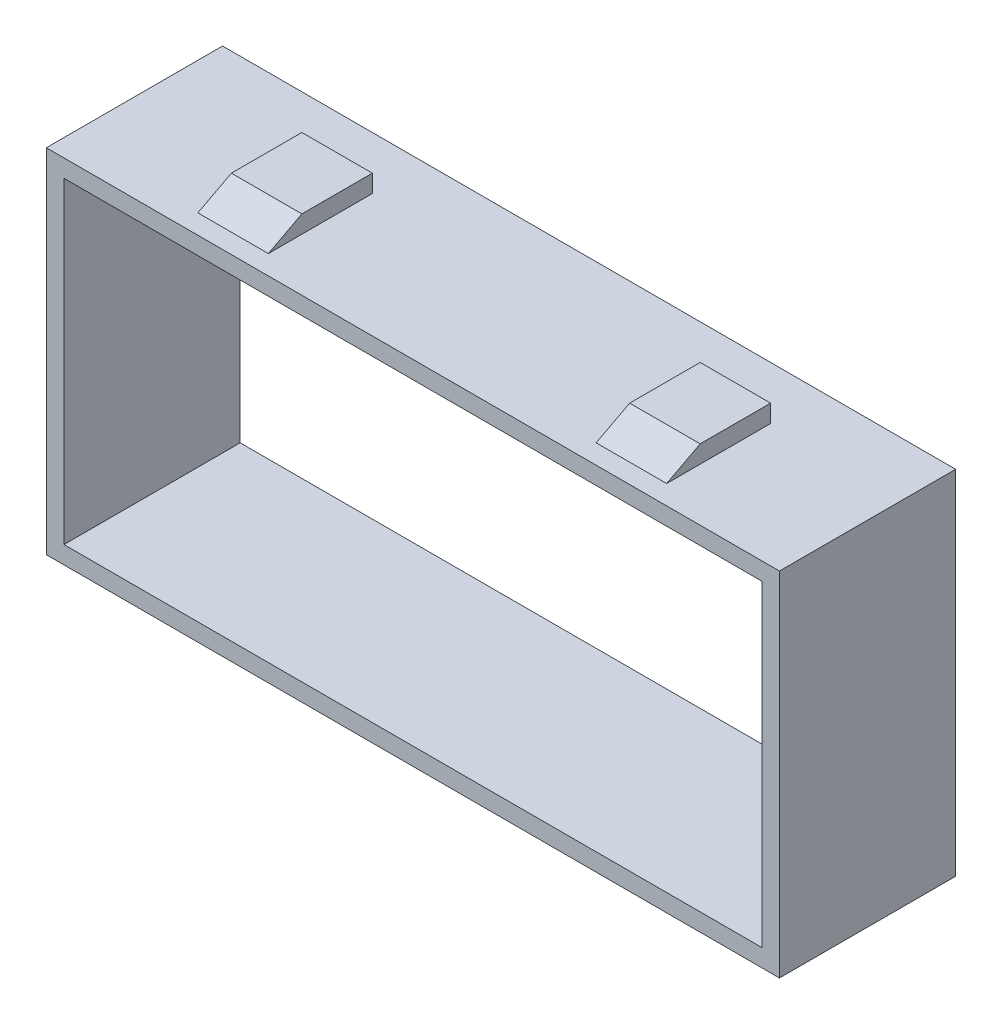
ISO-10303-21;
HEADER;
FILE_DESCRIPTION(('STEP AP214'),'2;1');
FILE_NAME('part.step','',(''),(''),'','','');
FILE_SCHEMA(('AUTOMOTIVE_DESIGN { 1 0 10303 214 1 1 1 1 }'));
ENDSEC;
DATA;
#1=APPLICATION_CONTEXT('core data for automotive mechanical design processes');
#2=APPLICATION_PROTOCOL_DEFINITION('international standard','automotive_design',2000,#1);
#3=PRODUCT_CONTEXT('',#1,'mechanical');
#4=PRODUCT('Part','Part','',(#3));
#5=PRODUCT_RELATED_PRODUCT_CATEGORY('part','',(#4));
#6=PRODUCT_DEFINITION_FORMATION('','',#4);
#7=PRODUCT_DEFINITION_CONTEXT('part definition',#1,'design');
#8=PRODUCT_DEFINITION('design','',#6,#7);
#9=PRODUCT_DEFINITION_SHAPE('','',#8);
#10=(LENGTH_UNIT() NAMED_UNIT(*) SI_UNIT(.MILLI.,.METRE.));
#11=(NAMED_UNIT(*) PLANE_ANGLE_UNIT() SI_UNIT($,.RADIAN.));
#12=(NAMED_UNIT(*) SI_UNIT($,.STERADIAN.) SOLID_ANGLE_UNIT());
#13=UNCERTAINTY_MEASURE_WITH_UNIT(LENGTH_MEASURE(1.E-05),#10,'distance_accuracy_value','');
#14=(GEOMETRIC_REPRESENTATION_CONTEXT(3) GLOBAL_UNCERTAINTY_ASSIGNED_CONTEXT((#13)) GLOBAL_UNIT_ASSIGNED_CONTEXT((#10,
#11,#12)) REPRESENTATION_CONTEXT('',''));
#15=CARTESIAN_POINT('',(0.,0.,0.));
#16=DIRECTION('',(0.,0.,1.));
#17=DIRECTION('',(1.,0.,0.));
#18=AXIS2_PLACEMENT_3D('',#15,#16,#17);
#19=CARTESIAN_POINT('',(13.3,11.,0.));
#20=DIRECTION('',(-1.,0.,0.));
#21=DIRECTION('',(0.,0.,1.));
#22=AXIS2_PLACEMENT_3D('',#19,#20,#21);
#23=PLANE('',#22);
#24=DIRECTION('',(0.,0.,-1.));
#25=VECTOR('',#24,1.);
#26=CARTESIAN_POINT('',(13.3,10.,0.));
#27=LINE('',#26,#25);
#28=CARTESIAN_POINT('',(13.3,10.,8.90014924755403));
#29=VERTEX_POINT('',#28);
#30=CARTESIAN_POINT('',(13.3,10.,3.00000000000001));
#31=VERTEX_POINT('',#30);
#32=EDGE_CURVE('E39',#29,#31,#27,.T.);
#33=ORIENTED_EDGE('',*,*,#32,.T.);
#34=DIRECTION('',(0.,-1.,0.));
#35=VECTOR('',#34,1.);
#36=CARTESIAN_POINT('',(13.3,0.,3.00000000000001));
#37=LINE('',#36,#35);
#38=CARTESIAN_POINT('',(13.3,11.,3.00000000000001));
#39=VERTEX_POINT('',#38);
#40=EDGE_CURVE('E53',#39,#31,#37,.T.);
#41=ORIENTED_EDGE('',*,*,#40,.F.);
#42=DIRECTION('',(0.,0.,-1.));
#43=VECTOR('',#42,1.);
#44=CARTESIAN_POINT('',(13.3,11.,0.));
#45=LINE('',#44,#43);
#46=CARTESIAN_POINT('',(13.3,11.,6.99999999999999));
#47=VERTEX_POINT('',#46);
#48=EDGE_CURVE('E210',#47,#39,#45,.T.);
#49=ORIENTED_EDGE('',*,*,#48,.F.);
#50=DIRECTION('',(0.,-0.465717785352861,0.884933299410767));
#51=VECTOR('',#50,1.);
#52=CARTESIAN_POINT('',(13.3,11.4990806231724,6.05167232941022));
#53=LINE('',#52,#51);
#54=EDGE_CURVE('E61',#47,#29,#53,.T.);
#55=ORIENTED_EDGE('',*,*,#54,.T.);
#56=EDGE_LOOP('',(#33,#41,#49,#55));
#57=FACE_BOUND('',#56,.T.);
#58=ADVANCED_FACE('F35',(#57),#23,.F.);
#59=CARTESIAN_POINT('',(9.3,11.,0.));
#60=DIRECTION('',(-1.,0.,0.));
#61=DIRECTION('',(0.,0.,1.));
#62=AXIS2_PLACEMENT_3D('',#59,#60,#61);
#63=PLANE('',#62);
#64=DIRECTION('',(0.,1.,0.));
#65=VECTOR('',#64,1.);
#66=CARTESIAN_POINT('',(9.3,11.,3.00000000000001));
#67=LINE('',#66,#65);
#68=CARTESIAN_POINT('',(9.3,10.,3.00000000000001));
#69=VERTEX_POINT('',#68);
#70=CARTESIAN_POINT('',(9.3,11.,3.00000000000001));
#71=VERTEX_POINT('',#70);
#72=EDGE_CURVE('E200',#69,#71,#67,.T.);
#73=ORIENTED_EDGE('',*,*,#72,.F.);
#74=DIRECTION('',(0.,0.,-1.));
#75=VECTOR('',#74,1.);
#76=CARTESIAN_POINT('',(9.3,10.,0.));
#77=LINE('',#76,#75);
#78=CARTESIAN_POINT('',(9.3,10.,8.90014924755403));
#79=VERTEX_POINT('',#78);
#80=EDGE_CURVE('E216',#79,#69,#77,.T.);
#81=ORIENTED_EDGE('',*,*,#80,.F.);
#82=DIRECTION('',(0.,0.465717785352861,-0.884933299410767));
#83=VECTOR('',#82,1.);
#84=CARTESIAN_POINT('',(9.3,13.8849042347061,1.51825138915781));
#85=LINE('',#84,#83);
#86=CARTESIAN_POINT('',(9.3,11.,6.99999999999999));
#87=VERTEX_POINT('',#86);
#88=EDGE_CURVE('E596',#79,#87,#85,.T.);
#89=ORIENTED_EDGE('',*,*,#88,.T.);
#90=DIRECTION('',(0.,0.,-1.));
#91=VECTOR('',#90,1.);
#92=CARTESIAN_POINT('',(9.3,11.,0.));
#93=LINE('',#92,#91);
#94=EDGE_CURVE('E215',#87,#71,#93,.T.);
#95=ORIENTED_EDGE('',*,*,#94,.T.);
#96=EDGE_LOOP('',(#73,#81,#89,#95));
#97=FACE_BOUND('',#96,.T.);
#98=ADVANCED_FACE('F365',(#97),#63,.T.);
#99=CARTESIAN_POINT('',(0.,11.,0.));
#100=DIRECTION('',(0.,1.,0.));
#101=DIRECTION('',(0.,0.,1.));
#102=AXIS2_PLACEMENT_3D('',#99,#100,#101);
#103=PLANE('',#102);
#104=DIRECTION('',(1.,0.,0.));
#105=VECTOR('',#104,1.);
#106=CARTESIAN_POINT('',(-13.7,11.,3.00000000000001));
#107=LINE('',#106,#105);
#108=EDGE_CURVE('E197',#71,#39,#107,.T.);
#109=ORIENTED_EDGE('',*,*,#108,.F.);
#110=ORIENTED_EDGE('',*,*,#94,.F.);
#111=DIRECTION('',(1.,0.,0.));
#112=VECTOR('',#111,1.);
#113=CARTESIAN_POINT('',(-13.7,11.,6.99999999999999));
#114=LINE('',#113,#112);
#115=EDGE_CURVE('E214',#87,#47,#114,.T.);
#116=ORIENTED_EDGE('',*,*,#115,.T.);
#117=ORIENTED_EDGE('',*,*,#48,.T.);
#118=EDGE_LOOP('',(#109,#110,#116,#117));
#119=FACE_BOUND('',#118,.T.);
#120=ADVANCED_FACE('F213',(#119),#103,.T.);
#121=CARTESIAN_POINT('',(-13.3,11.,0.));
#122=DIRECTION('',(-1.,0.,0.));
#123=DIRECTION('',(0.,0.,1.));
#124=AXIS2_PLACEMENT_3D('',#121,#122,#123);
#125=PLANE('',#124);
#126=DIRECTION('',(0.,1.,0.));
#127=VECTOR('',#126,1.);
#128=CARTESIAN_POINT('',(-13.3,11.,3.00000000000001));
#129=LINE('',#128,#127);
#130=CARTESIAN_POINT('',(-13.3,10.,3.00000000000001));
#131=VERTEX_POINT('',#130);
#132=CARTESIAN_POINT('',(-13.3,11.,3.00000000000001));
#133=VERTEX_POINT('',#132);
#134=EDGE_CURVE('E573',#131,#133,#129,.T.);
#135=ORIENTED_EDGE('',*,*,#134,.F.);
#136=DIRECTION('',(0.,0.,-1.));
#137=VECTOR('',#136,1.);
#138=CARTESIAN_POINT('',(-13.3,10.,0.));
#139=LINE('',#138,#137);
#140=CARTESIAN_POINT('',(-13.3,10.,8.90014924755403));
#141=VERTEX_POINT('',#140);
#142=EDGE_CURVE('E594',#141,#131,#139,.T.);
#143=ORIENTED_EDGE('',*,*,#142,.F.);
#144=DIRECTION('',(0.,0.465717785352861,-0.884933299410767));
#145=VECTOR('',#144,1.);
#146=CARTESIAN_POINT('',(-13.3,13.8849042347061,1.51825138915781));
#147=LINE('',#146,#145);
#148=CARTESIAN_POINT('',(-13.3,11.,6.99999999999999));
#149=VERTEX_POINT('',#148);
#150=EDGE_CURVE('E590',#141,#149,#147,.T.);
#151=ORIENTED_EDGE('',*,*,#150,.T.);
#152=DIRECTION('',(0.,0.,-1.));
#153=VECTOR('',#152,1.);
#154=CARTESIAN_POINT('',(-13.3,11.,0.));
#155=LINE('',#154,#153);
#156=EDGE_CURVE('E585',#149,#133,#155,.T.);
#157=ORIENTED_EDGE('',*,*,#156,.T.);
#158=EDGE_LOOP('',(#135,#143,#151,#157));
#159=FACE_BOUND('',#158,.T.);
#160=ADVANCED_FACE('F492',(#159),#125,.T.);
#161=CARTESIAN_POINT('',(-9.3,11.,0.));
#162=DIRECTION('',(-1.,0.,0.));
#163=DIRECTION('',(0.,0.,1.));
#164=AXIS2_PLACEMENT_3D('',#161,#162,#163);
#165=PLANE('',#164);
#166=DIRECTION('',(0.,0.,-1.));
#167=VECTOR('',#166,1.);
#168=CARTESIAN_POINT('',(-9.3,10.,0.));
#169=LINE('',#168,#167);
#170=CARTESIAN_POINT('',(-9.3,10.,8.90014924755403));
#171=VERTEX_POINT('',#170);
#172=CARTESIAN_POINT('',(-9.3,10.,3.00000000000001));
#173=VERTEX_POINT('',#172);
#174=EDGE_CURVE('E222',#171,#173,#169,.T.);
#175=ORIENTED_EDGE('',*,*,#174,.T.);
#176=DIRECTION('',(0.,1.,0.));
#177=VECTOR('',#176,1.);
#178=CARTESIAN_POINT('',(-9.3,11.,3.00000000000001));
#179=LINE('',#178,#177);
#180=CARTESIAN_POINT('',(-9.3,11.,3.00000000000001));
#181=VERTEX_POINT('',#180);
#182=EDGE_CURVE('E581',#173,#181,#179,.T.);
#183=ORIENTED_EDGE('',*,*,#182,.T.);
#184=DIRECTION('',(0.,0.,-1.));
#185=VECTOR('',#184,1.);
#186=CARTESIAN_POINT('',(-9.3,11.,0.));
#187=LINE('',#186,#185);
#188=CARTESIAN_POINT('',(-9.3,11.,6.99999999999999));
#189=VERTEX_POINT('',#188);
#190=EDGE_CURVE('E587',#189,#181,#187,.T.);
#191=ORIENTED_EDGE('',*,*,#190,.F.);
#192=DIRECTION('',(0.,0.465717785352861,-0.884933299410767));
#193=VECTOR('',#192,1.);
#194=CARTESIAN_POINT('',(-9.3,13.8849042347061,1.51825138915781));
#195=LINE('',#194,#193);
#196=EDGE_CURVE('E602',#171,#189,#195,.T.);
#197=ORIENTED_EDGE('',*,*,#196,.F.);
#198=EDGE_LOOP('',(#175,#183,#191,#197));
#199=FACE_BOUND('',#198,.T.);
#200=ADVANCED_FACE('F410',(#199),#165,.F.);
#201=CARTESIAN_POINT('',(0.,11.,0.));
#202=DIRECTION('',(0.,1.,0.));
#203=DIRECTION('',(0.,0.,1.));
#204=AXIS2_PLACEMENT_3D('',#201,#202,#203);
#205=PLANE('',#204);
#206=EDGE_CURVE('E205',#133,#181,#107,.T.);
#207=ORIENTED_EDGE('',*,*,#206,.F.);
#208=ORIENTED_EDGE('',*,*,#156,.F.);
#209=DIRECTION('',(1.,0.,0.));
#210=VECTOR('',#209,1.);
#211=CARTESIAN_POINT('',(0.,11.,6.99999999999999));
#212=LINE('',#211,#210);
#213=EDGE_CURVE('E11',#149,#189,#212,.T.);
#214=ORIENTED_EDGE('',*,*,#213,.T.);
#215=ORIENTED_EDGE('',*,*,#190,.T.);
#216=EDGE_LOOP('',(#207,#208,#214,#215));
#217=FACE_BOUND('',#216,.T.);
#218=ADVANCED_FACE('F405',(#217),#205,.T.);
#219=CARTESIAN_POINT('',(-13.3,-11.,0.));
#220=DIRECTION('',(1.,0.,0.));
#221=DIRECTION('',(0.,0.,-1.));
#222=AXIS2_PLACEMENT_3D('',#219,#220,#221);
#223=PLANE('',#222);
#224=DIRECTION('',(0.,-1.,0.));
#225=VECTOR('',#224,1.);
#226=CARTESIAN_POINT('',(-13.3,0.,3.));
#227=LINE('',#226,#225);
#228=CARTESIAN_POINT('',(-13.3,-10.,3.));
#229=VERTEX_POINT('',#228);
#230=CARTESIAN_POINT('',(-13.3,-11.,3.));
#231=VERTEX_POINT('',#230);
#232=EDGE_CURVE('E218',#229,#231,#227,.T.);
#233=ORIENTED_EDGE('',*,*,#232,.T.);
#234=DIRECTION('',(0.,0.,-1.));
#235=VECTOR('',#234,1.);
#236=CARTESIAN_POINT('',(-13.3,-11.,0.));
#237=LINE('',#236,#235);
#238=CARTESIAN_POINT('',(-13.3,-11.,6.99999999999999));
#239=VERTEX_POINT('',#238);
#240=EDGE_CURVE('E260',#239,#231,#237,.T.);
#241=ORIENTED_EDGE('',*,*,#240,.F.);
#242=DIRECTION('',(0.,0.465717785352861,0.884933299410767));
#243=VECTOR('',#242,1.);
#244=CARTESIAN_POINT('',(-13.3,-11.4990806231724,6.05167232941023));
#245=LINE('',#244,#243);
#246=CARTESIAN_POINT('',(-13.3,-10.,8.90014924755402));
#247=VERTEX_POINT('',#246);
#248=EDGE_CURVE('E452',#239,#247,#245,.T.);
#249=ORIENTED_EDGE('',*,*,#248,.T.);
#250=DIRECTION('',(0.,0.,-1.));
#251=VECTOR('',#250,1.);
#252=CARTESIAN_POINT('',(-13.3,-10.,0.));
#253=LINE('',#252,#251);
#254=EDGE_CURVE('E261',#247,#229,#253,.T.);
#255=ORIENTED_EDGE('',*,*,#254,.T.);
#256=EDGE_LOOP('',(#233,#241,#249,#255));
#257=FACE_BOUND('',#256,.T.);
#258=ADVANCED_FACE('F402',(#257),#223,.F.);
#259=CARTESIAN_POINT('',(-9.3,-11.,0.));
#260=DIRECTION('',(1.,0.,0.));
#261=DIRECTION('',(0.,0.,-1.));
#262=AXIS2_PLACEMENT_3D('',#259,#260,#261);
#263=PLANE('',#262);
#264=DIRECTION('',(0.,0.,-1.));
#265=VECTOR('',#264,1.);
#266=CARTESIAN_POINT('',(-9.3,-11.,0.));
#267=LINE('',#266,#265);
#268=CARTESIAN_POINT('',(-9.3,-11.,6.99999999999999));
#269=VERTEX_POINT('',#268);
#270=CARTESIAN_POINT('',(-9.3,-11.,3.));
#271=VERTEX_POINT('',#270);
#272=EDGE_CURVE('E282',#269,#271,#267,.T.);
#273=ORIENTED_EDGE('',*,*,#272,.T.);
#274=DIRECTION('',(0.,1.,0.));
#275=VECTOR('',#274,1.);
#276=CARTESIAN_POINT('',(-9.3,-11.,3.));
#277=LINE('',#276,#275);
#278=CARTESIAN_POINT('',(-9.3,-10.,3.));
#279=VERTEX_POINT('',#278);
#280=EDGE_CURVE('E455',#271,#279,#277,.T.);
#281=ORIENTED_EDGE('',*,*,#280,.T.);
#282=DIRECTION('',(0.,0.,-1.));
#283=VECTOR('',#282,1.);
#284=CARTESIAN_POINT('',(-9.3,-10.,0.));
#285=LINE('',#284,#283);
#286=CARTESIAN_POINT('',(-9.30000000000001,-10.,8.90014924755402));
#287=VERTEX_POINT('',#286);
#288=EDGE_CURVE('E257',#287,#279,#285,.T.);
#289=ORIENTED_EDGE('',*,*,#288,.F.);
#290=DIRECTION('',(0.,-0.465717785352861,-0.884933299410767));
#291=VECTOR('',#290,1.);
#292=CARTESIAN_POINT('',(-9.3,-13.8849042347061,1.51825138915782));
#293=LINE('',#292,#291);
#294=EDGE_CURVE('E436',#287,#269,#293,.T.);
#295=ORIENTED_EDGE('',*,*,#294,.T.);
#296=EDGE_LOOP('',(#273,#281,#289,#295));
#297=FACE_BOUND('',#296,.T.);
#298=ADVANCED_FACE('F398',(#297),#263,.T.);
#299=CARTESIAN_POINT('',(0.,-11.,0.));
#300=DIRECTION('',(0.,-1.,0.));
#301=DIRECTION('',(0.,0.,-1.));
#302=AXIS2_PLACEMENT_3D('',#299,#300,#301);
#303=PLANE('',#302);
#304=ORIENTED_EDGE('',*,*,#240,.T.);
#305=DIRECTION('',(-1.,0.,0.));
#306=VECTOR('',#305,1.);
#307=CARTESIAN_POINT('',(13.7,-11.,3.00000000000001));
#308=LINE('',#307,#306);
#309=EDGE_CURVE('E424',#271,#231,#308,.T.);
#310=ORIENTED_EDGE('',*,*,#309,.F.);
#311=ORIENTED_EDGE('',*,*,#272,.F.);
#312=DIRECTION('',(-1.,0.,0.));
#313=VECTOR('',#312,1.);
#314=CARTESIAN_POINT('',(13.7,-11.,6.99999999999999));
#315=LINE('',#314,#313);
#316=EDGE_CURVE('E426',#269,#239,#315,.T.);
#317=ORIENTED_EDGE('',*,*,#316,.T.);
#318=EDGE_LOOP('',(#304,#310,#311,#317));
#319=FACE_BOUND('',#318,.T.);
#320=ADVANCED_FACE('F394',(#319),#303,.T.);
#321=CARTESIAN_POINT('',(13.3,-11.,0.));
#322=DIRECTION('',(1.,0.,0.));
#323=DIRECTION('',(0.,0.,-1.));
#324=AXIS2_PLACEMENT_3D('',#321,#322,#323);
#325=PLANE('',#324);
#326=DIRECTION('',(0.,0.,-1.));
#327=VECTOR('',#326,1.);
#328=CARTESIAN_POINT('',(13.3,-11.,0.));
#329=LINE('',#328,#327);
#330=CARTESIAN_POINT('',(13.3,-11.,6.99999999999999));
#331=VERTEX_POINT('',#330);
#332=CARTESIAN_POINT('',(13.3,-11.,3.00000000000001));
#333=VERTEX_POINT('',#332);
#334=EDGE_CURVE('E432',#331,#333,#329,.T.);
#335=ORIENTED_EDGE('',*,*,#334,.T.);
#336=DIRECTION('',(0.,1.,0.));
#337=VECTOR('',#336,1.);
#338=CARTESIAN_POINT('',(13.3,-11.,3.00000000000001));
#339=LINE('',#338,#337);
#340=CARTESIAN_POINT('',(13.3,-10.,3.00000000000001));
#341=VERTEX_POINT('',#340);
#342=EDGE_CURVE('E458',#333,#341,#339,.T.);
#343=ORIENTED_EDGE('',*,*,#342,.T.);
#344=DIRECTION('',(0.,0.,-1.));
#345=VECTOR('',#344,1.);
#346=CARTESIAN_POINT('',(13.3,-10.,0.));
#347=LINE('',#346,#345);
#348=CARTESIAN_POINT('',(13.3,-10.,8.90014924755403));
#349=VERTEX_POINT('',#348);
#350=EDGE_CURVE('E433',#349,#341,#347,.T.);
#351=ORIENTED_EDGE('',*,*,#350,.F.);
#352=DIRECTION('',(0.,-0.465717785352861,-0.884933299410767));
#353=VECTOR('',#352,1.);
#354=CARTESIAN_POINT('',(13.3,-13.8849042347061,1.51825138915782));
#355=LINE('',#354,#353);
#356=EDGE_CURVE('E444',#349,#331,#355,.T.);
#357=ORIENTED_EDGE('',*,*,#356,.T.);
#358=EDGE_LOOP('',(#335,#343,#351,#357));
#359=FACE_BOUND('',#358,.T.);
#360=ADVANCED_FACE('F390',(#359),#325,.T.);
#361=CARTESIAN_POINT('',(9.3,-11.,0.));
#362=DIRECTION('',(1.,0.,0.));
#363=DIRECTION('',(0.,0.,-1.));
#364=AXIS2_PLACEMENT_3D('',#361,#362,#363);
#365=PLANE('',#364);
#366=DIRECTION('',(0.,1.,0.));
#367=VECTOR('',#366,1.);
#368=CARTESIAN_POINT('',(9.3,-11.,3.00000000000001));
#369=LINE('',#368,#367);
#370=CARTESIAN_POINT('',(9.3,-11.,3.00000000000001));
#371=VERTEX_POINT('',#370);
#372=CARTESIAN_POINT('',(9.3,-10.,3.00000000000001));
#373=VERTEX_POINT('',#372);
#374=EDGE_CURVE('E461',#371,#373,#369,.T.);
#375=ORIENTED_EDGE('',*,*,#374,.F.);
#376=DIRECTION('',(0.,0.,-1.));
#377=VECTOR('',#376,1.);
#378=CARTESIAN_POINT('',(9.3,-11.,0.));
#379=LINE('',#378,#377);
#380=CARTESIAN_POINT('',(9.3,-11.,7.));
#381=VERTEX_POINT('',#380);
#382=EDGE_CURVE('E437',#381,#371,#379,.T.);
#383=ORIENTED_EDGE('',*,*,#382,.F.);
#384=DIRECTION('',(0.,-0.465717785352861,-0.884933299410767));
#385=VECTOR('',#384,1.);
#386=CARTESIAN_POINT('',(9.3,-13.8849042347061,1.51825138915782));
#387=LINE('',#386,#385);
#388=CARTESIAN_POINT('',(9.3,-10.,8.90014924755402));
#389=VERTEX_POINT('',#388);
#390=EDGE_CURVE('E447',#389,#381,#387,.T.);
#391=ORIENTED_EDGE('',*,*,#390,.F.);
#392=DIRECTION('',(0.,0.,-1.));
#393=VECTOR('',#392,1.);
#394=CARTESIAN_POINT('',(9.3,-10.,0.));
#395=LINE('',#394,#393);
#396=EDGE_CURVE('E429',#389,#373,#395,.T.);
#397=ORIENTED_EDGE('',*,*,#396,.T.);
#398=EDGE_LOOP('',(#375,#383,#391,#397));
#399=FACE_BOUND('',#398,.T.);
#400=ADVANCED_FACE('F386',(#399),#365,.F.);
#401=CARTESIAN_POINT('',(0.,-11.,0.));
#402=DIRECTION('',(0.,-1.,0.));
#403=DIRECTION('',(0.,0.,-1.));
#404=AXIS2_PLACEMENT_3D('',#401,#402,#403);
#405=PLANE('',#404);
#406=ORIENTED_EDGE('',*,*,#382,.T.);
#407=EDGE_CURVE('E463',#333,#371,#308,.T.);
#408=ORIENTED_EDGE('',*,*,#407,.F.);
#409=ORIENTED_EDGE('',*,*,#334,.F.);
#410=DIRECTION('',(-1.,0.,0.));
#411=VECTOR('',#410,1.);
#412=CARTESIAN_POINT('',(0.,-11.,7.));
#413=LINE('',#412,#411);
#414=EDGE_CURVE('E45',#331,#381,#413,.T.);
#415=ORIENTED_EDGE('',*,*,#414,.T.);
#416=EDGE_LOOP('',(#406,#408,#409,#415));
#417=FACE_BOUND('',#416,.T.);
#418=ADVANCED_FACE('F383',(#417),#405,.T.);
#419=CARTESIAN_POINT('',(0.,0.,10.));
#420=DIRECTION('',(0.,0.,1.));
#421=DIRECTION('',(1.,0.,0.));
#422=AXIS2_PLACEMENT_3D('',#419,#420,#421);
#423=PLANE('',#422);
#424=DIRECTION('',(-1.,0.,0.));
#425=VECTOR('',#424,1.);
#426=CARTESIAN_POINT('',(-20.8,10.,10.));
#427=LINE('',#426,#425);
#428=CARTESIAN_POINT('',(20.8,10.,10.));
#429=VERTEX_POINT('',#428);
#430=CARTESIAN_POINT('',(-20.8,10.,10.));
#431=VERTEX_POINT('',#430);
#432=EDGE_CURVE('E230',#429,#431,#427,.T.);
#433=ORIENTED_EDGE('',*,*,#432,.T.);
#434=DIRECTION('',(0.,-1.,0.));
#435=VECTOR('',#434,1.);
#436=CARTESIAN_POINT('',(-20.8,10.,10.));
#437=LINE('',#436,#435);
#438=CARTESIAN_POINT('',(-20.8,-10.,10.));
#439=VERTEX_POINT('',#438);
#440=EDGE_CURVE('E233',#431,#439,#437,.T.);
#441=ORIENTED_EDGE('',*,*,#440,.T.);
#442=DIRECTION('',(1.,0.,0.));
#443=VECTOR('',#442,1.);
#444=CARTESIAN_POINT('',(-20.8,-10.,10.));
#445=LINE('',#444,#443);
#446=CARTESIAN_POINT('',(20.8,-10.,10.));
#447=VERTEX_POINT('',#446);
#448=EDGE_CURVE('E243',#439,#447,#445,.T.);
#449=ORIENTED_EDGE('',*,*,#448,.T.);
#450=DIRECTION('',(0.,1.,0.));
#451=VECTOR('',#450,1.);
#452=CARTESIAN_POINT('',(20.8,10.,10.));
#453=LINE('',#452,#451);
#454=EDGE_CURVE('E234',#447,#429,#453,.T.);
#455=ORIENTED_EDGE('',*,*,#454,.T.);
#456=EDGE_LOOP('',(#433,#441,#449,#455));
#457=FACE_BOUND('',#456,.T.);
#458=DIRECTION('',(0.,-1.,0.));
#459=VECTOR('',#458,1.);
#460=CARTESIAN_POINT('',(-19.8,9.,10.));
#461=LINE('',#460,#459);
#462=CARTESIAN_POINT('',(-19.8,9.,10.));
#463=VERTEX_POINT('',#462);
#464=CARTESIAN_POINT('',(-19.8,-9.,10.));
#465=VERTEX_POINT('',#464);
#466=EDGE_CURVE('E269',#463,#465,#461,.T.);
#467=ORIENTED_EDGE('',*,*,#466,.F.);
#468=DIRECTION('',(-1.,0.,0.));
#469=VECTOR('',#468,1.);
#470=CARTESIAN_POINT('',(-19.8,9.,10.));
#471=LINE('',#470,#469);
#472=CARTESIAN_POINT('',(19.8,9.,10.));
#473=VERTEX_POINT('',#472);
#474=EDGE_CURVE('E267',#473,#463,#471,.T.);
#475=ORIENTED_EDGE('',*,*,#474,.F.);
#476=DIRECTION('',(0.,1.,0.));
#477=VECTOR('',#476,1.);
#478=CARTESIAN_POINT('',(19.8,9.,10.));
#479=LINE('',#478,#477);
#480=CARTESIAN_POINT('',(19.8,-9.,10.));
#481=VERTEX_POINT('',#480);
#482=EDGE_CURVE('E275',#481,#473,#479,.T.);
#483=ORIENTED_EDGE('',*,*,#482,.F.);
#484=DIRECTION('',(1.,0.,0.));
#485=VECTOR('',#484,1.);
#486=CARTESIAN_POINT('',(-19.8,-9.,10.));
#487=LINE('',#486,#485);
#488=EDGE_CURVE('E272',#465,#481,#487,.T.);
#489=ORIENTED_EDGE('',*,*,#488,.F.);
#490=EDGE_LOOP('',(#467,#475,#483,#489));
#491=FACE_BOUND('',#490,.T.);
#492=ADVANCED_FACE('F327',(#457,#491),#423,.T.);
#493=CARTESIAN_POINT('',(0.,0.,0.));
#494=DIRECTION('',(0.,0.,1.));
#495=DIRECTION('',(1.,0.,0.));
#496=AXIS2_PLACEMENT_3D('',#493,#494,#495);
#497=PLANE('',#496);
#498=DIRECTION('',(0.,-1.,0.));
#499=VECTOR('',#498,1.);
#500=CARTESIAN_POINT('',(-20.8,10.,0.));
#501=LINE('',#500,#499);
#502=CARTESIAN_POINT('',(-20.8,10.,0.));
#503=VERTEX_POINT('',#502);
#504=CARTESIAN_POINT('',(-20.8,-10.,0.));
#505=VERTEX_POINT('',#504);
#506=EDGE_CURVE('E304',#503,#505,#501,.T.);
#507=ORIENTED_EDGE('',*,*,#506,.F.);
#508=DIRECTION('',(-1.,0.,0.));
#509=VECTOR('',#508,1.);
#510=CARTESIAN_POINT('',(-20.8,10.,0.));
#511=LINE('',#510,#509);
#512=CARTESIAN_POINT('',(20.8,10.,0.));
#513=VERTEX_POINT('',#512);
#514=EDGE_CURVE('E235',#513,#503,#511,.T.);
#515=ORIENTED_EDGE('',*,*,#514,.F.);
#516=DIRECTION('',(0.,1.,0.));
#517=VECTOR('',#516,1.);
#518=CARTESIAN_POINT('',(20.8,10.,0.));
#519=LINE('',#518,#517);
#520=CARTESIAN_POINT('',(20.8,-10.,0.));
#521=VERTEX_POINT('',#520);
#522=EDGE_CURVE('E246',#521,#513,#519,.T.);
#523=ORIENTED_EDGE('',*,*,#522,.F.);
#524=DIRECTION('',(1.,0.,0.));
#525=VECTOR('',#524,1.);
#526=CARTESIAN_POINT('',(-20.8,-10.,0.));
#527=LINE('',#526,#525);
#528=EDGE_CURVE('E251',#505,#521,#527,.T.);
#529=ORIENTED_EDGE('',*,*,#528,.F.);
#530=EDGE_LOOP('',(#507,#515,#523,#529));
#531=FACE_BOUND('',#530,.T.);
#532=DIRECTION('',(-1.,0.,0.));
#533=VECTOR('',#532,1.);
#534=CARTESIAN_POINT('',(-19.8,9.,0.));
#535=LINE('',#534,#533);
#536=CARTESIAN_POINT('',(19.8,9.,0.));
#537=VERTEX_POINT('',#536);
#538=CARTESIAN_POINT('',(-19.8,9.,0.));
#539=VERTEX_POINT('',#538);
#540=EDGE_CURVE('E278',#537,#539,#535,.T.);
#541=ORIENTED_EDGE('',*,*,#540,.T.);
#542=DIRECTION('',(0.,-1.,0.));
#543=VECTOR('',#542,1.);
#544=CARTESIAN_POINT('',(-19.8,9.,0.));
#545=LINE('',#544,#543);
#546=CARTESIAN_POINT('',(-19.8,-9.,0.));
#547=VERTEX_POINT('',#546);
#548=EDGE_CURVE('E281',#539,#547,#545,.T.);
#549=ORIENTED_EDGE('',*,*,#548,.T.);
#550=DIRECTION('',(1.,0.,0.));
#551=VECTOR('',#550,1.);
#552=CARTESIAN_POINT('',(-19.8,-9.,0.));
#553=LINE('',#552,#551);
#554=CARTESIAN_POINT('',(19.8,-9.,0.));
#555=VERTEX_POINT('',#554);
#556=EDGE_CURVE('E285',#547,#555,#553,.T.);
#557=ORIENTED_EDGE('',*,*,#556,.T.);
#558=DIRECTION('',(0.,1.,0.));
#559=VECTOR('',#558,1.);
#560=CARTESIAN_POINT('',(19.8,9.,0.));
#561=LINE('',#560,#559);
#562=EDGE_CURVE('E270',#555,#537,#561,.T.);
#563=ORIENTED_EDGE('',*,*,#562,.T.);
#564=EDGE_LOOP('',(#541,#549,#557,#563));
#565=FACE_BOUND('',#564,.T.);
#566=ADVANCED_FACE('F336',(#531,#565),#497,.F.);
#567=CARTESIAN_POINT('',(20.8,10.,10.));
#568=DIRECTION('',(-1.,0.,0.));
#569=DIRECTION('',(0.,-1.,0.));
#570=AXIS2_PLACEMENT_3D('',#567,#568,#569);
#571=PLANE('',#570);
#572=ORIENTED_EDGE('',*,*,#522,.T.);
#573=DIRECTION('',(0.,0.,-1.));
#574=VECTOR('',#573,1.);
#575=CARTESIAN_POINT('',(20.8,10.,10.));
#576=LINE('',#575,#574);
#577=EDGE_CURVE('E256',#429,#513,#576,.T.);
#578=ORIENTED_EDGE('',*,*,#577,.F.);
#579=ORIENTED_EDGE('',*,*,#454,.F.);
#580=DIRECTION('',(0.,0.,-1.));
#581=VECTOR('',#580,1.);
#582=CARTESIAN_POINT('',(20.8,-10.,10.));
#583=LINE('',#582,#581);
#584=EDGE_CURVE('E250',#447,#521,#583,.T.);
#585=ORIENTED_EDGE('',*,*,#584,.T.);
#586=EDGE_LOOP('',(#572,#578,#579,#585));
#587=FACE_BOUND('',#586,.T.);
#588=ADVANCED_FACE('F37',(#587),#571,.F.);
#589=CARTESIAN_POINT('',(-20.8,10.,10.));
#590=DIRECTION('',(0.,-1.,0.));
#591=DIRECTION('',(0.,0.,-1.));
#592=AXIS2_PLACEMENT_3D('',#589,#590,#591);
#593=PLANE('',#592);
#594=ORIENTED_EDGE('',*,*,#514,.T.);
#595=DIRECTION('',(0.,0.,-1.));
#596=VECTOR('',#595,1.);
#597=CARTESIAN_POINT('',(-20.8,10.,10.));
#598=LINE('',#597,#596);
#599=EDGE_CURVE('E320',#431,#503,#598,.T.);
#600=ORIENTED_EDGE('',*,*,#599,.F.);
#601=ORIENTED_EDGE('',*,*,#432,.F.);
#602=ORIENTED_EDGE('',*,*,#577,.T.);
#603=EDGE_LOOP('',(#594,#600,#601,#602));
#604=FACE_BOUND('',#603,.T.);
#605=ORIENTED_EDGE('',*,*,#80,.T.);
#606=DIRECTION('',(1.,0.,0.));
#607=VECTOR('',#606,1.);
#608=CARTESIAN_POINT('',(-13.7,10.,3.00000000000001));
#609=LINE('',#608,#607);
#610=EDGE_CURVE('E588',#69,#31,#609,.T.);
#611=ORIENTED_EDGE('',*,*,#610,.T.);
#612=ORIENTED_EDGE('',*,*,#32,.F.);
#613=DIRECTION('',(1.,0.,0.));
#614=VECTOR('',#613,1.);
#615=CARTESIAN_POINT('',(-13.7,10.,8.90014924755403));
#616=LINE('',#615,#614);
#617=EDGE_CURVE('E607',#79,#29,#616,.T.);
#618=ORIENTED_EDGE('',*,*,#617,.F.);
#619=EDGE_LOOP('',(#605,#611,#612,#618));
#620=FACE_BOUND('',#619,.T.);
#621=ORIENTED_EDGE('',*,*,#142,.T.);
#622=EDGE_CURVE('E577',#131,#173,#609,.T.);
#623=ORIENTED_EDGE('',*,*,#622,.T.);
#624=ORIENTED_EDGE('',*,*,#174,.F.);
#625=EDGE_CURVE('E603',#141,#171,#616,.T.);
#626=ORIENTED_EDGE('',*,*,#625,.F.);
#627=EDGE_LOOP('',(#621,#623,#624,#626));
#628=FACE_BOUND('',#627,.T.);
#629=ADVANCED_FACE('F321',(#604,#620,#628),#593,.F.);
#630=CARTESIAN_POINT('',(-20.8,10.,10.));
#631=DIRECTION('',(1.,0.,0.));
#632=DIRECTION('',(0.,1.,0.));
#633=AXIS2_PLACEMENT_3D('',#630,#631,#632);
#634=PLANE('',#633);
#635=ORIENTED_EDGE('',*,*,#506,.T.);
#636=DIRECTION('',(0.,0.,-1.));
#637=VECTOR('',#636,1.);
#638=CARTESIAN_POINT('',(-20.8,-10.,10.));
#639=LINE('',#638,#637);
#640=EDGE_CURVE('E318',#439,#505,#639,.T.);
#641=ORIENTED_EDGE('',*,*,#640,.F.);
#642=ORIENTED_EDGE('',*,*,#440,.F.);
#643=ORIENTED_EDGE('',*,*,#599,.T.);
#644=EDGE_LOOP('',(#635,#641,#642,#643));
#645=FACE_BOUND('',#644,.T.);
#646=ADVANCED_FACE('F540',(#645),#634,.F.);
#647=CARTESIAN_POINT('',(-20.8,-10.,10.));
#648=DIRECTION('',(0.,1.,0.));
#649=DIRECTION('',(0.,0.,1.));
#650=AXIS2_PLACEMENT_3D('',#647,#648,#649);
#651=PLANE('',#650);
#652=ORIENTED_EDGE('',*,*,#528,.T.);
#653=ORIENTED_EDGE('',*,*,#584,.F.);
#654=ORIENTED_EDGE('',*,*,#448,.F.);
#655=ORIENTED_EDGE('',*,*,#640,.T.);
#656=EDGE_LOOP('',(#652,#653,#654,#655));
#657=FACE_BOUND('',#656,.T.);
#658=ORIENTED_EDGE('',*,*,#288,.T.);
#659=DIRECTION('',(-1.,0.,0.));
#660=VECTOR('',#659,1.);
#661=CARTESIAN_POINT('',(13.7,-10.,3.00000000000001));
#662=LINE('',#661,#660);
#663=EDGE_CURVE('E420',#279,#229,#662,.T.);
#664=ORIENTED_EDGE('',*,*,#663,.T.);
#665=ORIENTED_EDGE('',*,*,#254,.F.);
#666=DIRECTION('',(-1.,0.,0.));
#667=VECTOR('',#666,1.);
#668=CARTESIAN_POINT('',(13.7,-10.,8.90014924755403));
#669=LINE('',#668,#667);
#670=EDGE_CURVE('E451',#287,#247,#669,.T.);
#671=ORIENTED_EDGE('',*,*,#670,.F.);
#672=EDGE_LOOP('',(#658,#664,#665,#671));
#673=FACE_BOUND('',#672,.T.);
#674=ORIENTED_EDGE('',*,*,#350,.T.);
#675=EDGE_CURVE('E464',#341,#373,#662,.T.);
#676=ORIENTED_EDGE('',*,*,#675,.T.);
#677=ORIENTED_EDGE('',*,*,#396,.F.);
#678=EDGE_CURVE('E449',#349,#389,#669,.T.);
#679=ORIENTED_EDGE('',*,*,#678,.F.);
#680=EDGE_LOOP('',(#674,#676,#677,#679));
#681=FACE_BOUND('',#680,.T.);
#682=ADVANCED_FACE('F332',(#657,#673,#681),#651,.F.);
#683=CARTESIAN_POINT('',(-19.8,9.,10.));
#684=DIRECTION('',(0.,-1.,0.));
#685=DIRECTION('',(0.,0.,-1.));
#686=AXIS2_PLACEMENT_3D('',#683,#684,#685);
#687=PLANE('',#686);
#688=ORIENTED_EDGE('',*,*,#540,.F.);
#689=DIRECTION('',(0.,0.,-1.));
#690=VECTOR('',#689,1.);
#691=CARTESIAN_POINT('',(19.8,9.,10.));
#692=LINE('',#691,#690);
#693=EDGE_CURVE('E277',#473,#537,#692,.T.);
#694=ORIENTED_EDGE('',*,*,#693,.F.);
#695=ORIENTED_EDGE('',*,*,#474,.T.);
#696=DIRECTION('',(0.,0.,-1.));
#697=VECTOR('',#696,1.);
#698=CARTESIAN_POINT('',(-19.8,9.,10.));
#699=LINE('',#698,#697);
#700=EDGE_CURVE('E295',#463,#539,#699,.T.);
#701=ORIENTED_EDGE('',*,*,#700,.T.);
#702=EDGE_LOOP('',(#688,#694,#695,#701));
#703=FACE_BOUND('',#702,.T.);
#704=ADVANCED_FACE('F342',(#703),#687,.T.);
#705=CARTESIAN_POINT('',(-19.8,9.,10.));
#706=DIRECTION('',(1.,0.,0.));
#707=DIRECTION('',(0.,0.,-1.));
#708=AXIS2_PLACEMENT_3D('',#705,#706,#707);
#709=PLANE('',#708);
#710=ORIENTED_EDGE('',*,*,#548,.F.);
#711=ORIENTED_EDGE('',*,*,#700,.F.);
#712=ORIENTED_EDGE('',*,*,#466,.T.);
#713=DIRECTION('',(0.,0.,-1.));
#714=VECTOR('',#713,1.);
#715=CARTESIAN_POINT('',(-19.8,-9.,10.));
#716=LINE('',#715,#714);
#717=EDGE_CURVE('E294',#465,#547,#716,.T.);
#718=ORIENTED_EDGE('',*,*,#717,.T.);
#719=EDGE_LOOP('',(#710,#711,#712,#718));
#720=FACE_BOUND('',#719,.T.);
#721=ADVANCED_FACE('F350',(#720),#709,.T.);
#722=CARTESIAN_POINT('',(-19.8,-9.,10.));
#723=DIRECTION('',(0.,1.,0.));
#724=DIRECTION('',(0.,0.,1.));
#725=AXIS2_PLACEMENT_3D('',#722,#723,#724);
#726=PLANE('',#725);
#727=ORIENTED_EDGE('',*,*,#556,.F.);
#728=ORIENTED_EDGE('',*,*,#717,.F.);
#729=ORIENTED_EDGE('',*,*,#488,.T.);
#730=DIRECTION('',(0.,0.,-1.));
#731=VECTOR('',#730,1.);
#732=CARTESIAN_POINT('',(19.8,-9.,10.));
#733=LINE('',#732,#731);
#734=EDGE_CURVE('E292',#481,#555,#733,.T.);
#735=ORIENTED_EDGE('',*,*,#734,.T.);
#736=EDGE_LOOP('',(#727,#728,#729,#735));
#737=FACE_BOUND('',#736,.T.);
#738=ADVANCED_FACE('F354',(#737),#726,.T.);
#739=CARTESIAN_POINT('',(19.8,9.,10.));
#740=DIRECTION('',(-1.,0.,0.));
#741=DIRECTION('',(0.,-1.,0.));
#742=AXIS2_PLACEMENT_3D('',#739,#740,#741);
#743=PLANE('',#742);
#744=ORIENTED_EDGE('',*,*,#562,.F.);
#745=ORIENTED_EDGE('',*,*,#734,.F.);
#746=ORIENTED_EDGE('',*,*,#482,.T.);
#747=ORIENTED_EDGE('',*,*,#693,.T.);
#748=EDGE_LOOP('',(#744,#745,#746,#747));
#749=FACE_BOUND('',#748,.T.);
#750=ADVANCED_FACE('F345',(#749),#743,.T.);
#751=CARTESIAN_POINT('',(13.7,-11.4990806231724,6.05167232941024));
#752=DIRECTION('',(0.,-0.884933299410767,0.465717785352861));
#753=DIRECTION('',(0.,-0.465717785352861,-0.884933299410767));
#754=AXIS2_PLACEMENT_3D('',#751,#752,#753);
#755=PLANE('',#754);
#756=ORIENTED_EDGE('',*,*,#678,.T.);
#757=ORIENTED_EDGE('',*,*,#390,.T.);
#758=ORIENTED_EDGE('',*,*,#414,.F.);
#759=ORIENTED_EDGE('',*,*,#356,.F.);
#760=EDGE_LOOP('',(#756,#757,#758,#759));
#761=FACE_BOUND('',#760,.T.);
#762=ADVANCED_FACE('F361',(#761),#755,.T.);
#763=ORIENTED_EDGE('',*,*,#670,.T.);
#764=ORIENTED_EDGE('',*,*,#248,.F.);
#765=ORIENTED_EDGE('',*,*,#316,.F.);
#766=ORIENTED_EDGE('',*,*,#294,.F.);
#767=EDGE_LOOP('',(#763,#764,#765,#766));
#768=FACE_BOUND('',#767,.T.);
#769=ADVANCED_FACE('F378',(#768),#755,.T.);
#770=CARTESIAN_POINT('',(13.7,0.,3.00000000000001));
#771=DIRECTION('',(0.,0.,-1.));
#772=DIRECTION('',(-1.,0.,0.));
#773=AXIS2_PLACEMENT_3D('',#770,#771,#772);
#774=PLANE('',#773);
#775=ORIENTED_EDGE('',*,*,#309,.T.);
#776=ORIENTED_EDGE('',*,*,#232,.F.);
#777=ORIENTED_EDGE('',*,*,#663,.F.);
#778=ORIENTED_EDGE('',*,*,#280,.F.);
#779=EDGE_LOOP('',(#775,#776,#777,#778));
#780=FACE_BOUND('',#779,.T.);
#781=ADVANCED_FACE('F374',(#780),#774,.T.);
#782=ORIENTED_EDGE('',*,*,#407,.T.);
#783=ORIENTED_EDGE('',*,*,#374,.T.);
#784=ORIENTED_EDGE('',*,*,#675,.F.);
#785=ORIENTED_EDGE('',*,*,#342,.F.);
#786=EDGE_LOOP('',(#782,#783,#784,#785));
#787=FACE_BOUND('',#786,.T.);
#788=ADVANCED_FACE('F377',(#787),#774,.T.);
#789=CARTESIAN_POINT('',(-13.7,11.4990806231724,6.05167232941022));
#790=DIRECTION('',(0.,0.884933299410767,0.465717785352861));
#791=DIRECTION('',(0.,-0.465717785352861,0.884933299410767));
#792=AXIS2_PLACEMENT_3D('',#789,#790,#791);
#793=PLANE('',#792);
#794=ORIENTED_EDGE('',*,*,#625,.T.);
#795=ORIENTED_EDGE('',*,*,#196,.T.);
#796=ORIENTED_EDGE('',*,*,#213,.F.);
#797=ORIENTED_EDGE('',*,*,#150,.F.);
#798=EDGE_LOOP('',(#794,#795,#796,#797));
#799=FACE_BOUND('',#798,.T.);
#800=ADVANCED_FACE('F478',(#799),#793,.T.);
#801=ORIENTED_EDGE('',*,*,#617,.T.);
#802=ORIENTED_EDGE('',*,*,#54,.F.);
#803=ORIENTED_EDGE('',*,*,#115,.F.);
#804=ORIENTED_EDGE('',*,*,#88,.F.);
#805=EDGE_LOOP('',(#801,#802,#803,#804));
#806=FACE_BOUND('',#805,.T.);
#807=ADVANCED_FACE('F482',(#806),#793,.T.);
#808=CARTESIAN_POINT('',(-13.7,0.,3.00000000000001));
#809=DIRECTION('',(0.,0.,1.));
#810=DIRECTION('',(1.,0.,0.));
#811=AXIS2_PLACEMENT_3D('',#808,#809,#810);
#812=PLANE('',#811);
#813=ORIENTED_EDGE('',*,*,#72,.T.);
#814=ORIENTED_EDGE('',*,*,#108,.T.);
#815=ORIENTED_EDGE('',*,*,#40,.T.);
#816=ORIENTED_EDGE('',*,*,#610,.F.);
#817=EDGE_LOOP('',(#813,#814,#815,#816));
#818=FACE_BOUND('',#817,.T.);
#819=ADVANCED_FACE('F198',(#818),#812,.F.);
#820=ORIENTED_EDGE('',*,*,#134,.T.);
#821=ORIENTED_EDGE('',*,*,#206,.T.);
#822=ORIENTED_EDGE('',*,*,#182,.F.);
#823=ORIENTED_EDGE('',*,*,#622,.F.);
#824=EDGE_LOOP('',(#820,#821,#822,#823));
#825=FACE_BOUND('',#824,.T.);
#826=ADVANCED_FACE('F561',(#825),#812,.F.);
#827=CLOSED_SHELL('',(#58,#98,#120,#160,#200,#218,#258,#298,#320,#360,#400,#418,#492,#566,#588,
#629,#646,#682,#704,#721,#738,#750,#762,#769,#781,#788,#800,#807,#819,#826));
#828=MANIFOLD_SOLID_BREP('B2',#827);
#829=ADVANCED_BREP_SHAPE_REPRESENTATION('',(#18,#828),#14);
#830=SHAPE_DEFINITION_REPRESENTATION(#9,#829);
ENDSEC;
END-ISO-10303-21;
